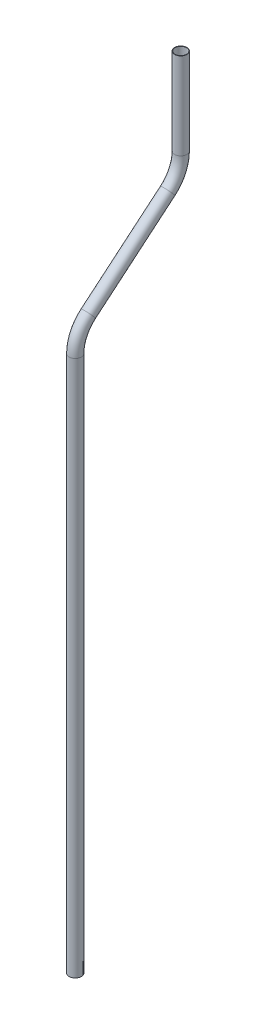
ISO-10303-21;
HEADER;
FILE_DESCRIPTION(('STEP AP214'),'2;1');
FILE_NAME('part.step','',(''),(''),'','','');
FILE_SCHEMA(('AUTOMOTIVE_DESIGN { 1 0 10303 214 1 1 1 1 }'));
ENDSEC;
DATA;
#1=APPLICATION_CONTEXT('core data for automotive mechanical design processes');
#2=APPLICATION_PROTOCOL_DEFINITION('international standard','automotive_design',2000,#1);
#3=PRODUCT_CONTEXT('',#1,'mechanical');
#4=PRODUCT('Part','Part','',(#3));
#5=PRODUCT_RELATED_PRODUCT_CATEGORY('part','',(#4));
#6=PRODUCT_DEFINITION_FORMATION('','',#4);
#7=PRODUCT_DEFINITION_CONTEXT('part definition',#1,'design');
#8=PRODUCT_DEFINITION('design','',#6,#7);
#9=PRODUCT_DEFINITION_SHAPE('','',#8);
#10=(LENGTH_UNIT() NAMED_UNIT(*) SI_UNIT(.MILLI.,.METRE.));
#11=(NAMED_UNIT(*) PLANE_ANGLE_UNIT() SI_UNIT($,.RADIAN.));
#12=(NAMED_UNIT(*) SI_UNIT($,.STERADIAN.) SOLID_ANGLE_UNIT());
#13=UNCERTAINTY_MEASURE_WITH_UNIT(LENGTH_MEASURE(1.E-05),#10,'distance_accuracy_value','');
#14=(GEOMETRIC_REPRESENTATION_CONTEXT(3) GLOBAL_UNCERTAINTY_ASSIGNED_CONTEXT((#13)) GLOBAL_UNIT_ASSIGNED_CONTEXT((#10,
#11,#12)) REPRESENTATION_CONTEXT('',''));
#15=CARTESIAN_POINT('',(0.,0.,0.));
#16=DIRECTION('',(0.,0.,1.));
#17=DIRECTION('',(1.,0.,0.));
#18=AXIS2_PLACEMENT_3D('',#15,#16,#17);
#19=CARTESIAN_POINT('',(0.,0.,0.));
#20=DIRECTION('',(0.,1.,0.));
#21=DIRECTION('',(0.,0.,1.));
#22=AXIS2_PLACEMENT_3D('',#19,#20,#21);
#23=CYLINDRICAL_SURFACE('',#22,6.35);
#24=CARTESIAN_POINT('',(0.,558.8,0.));
#25=DIRECTION('',(0.,1.,0.));
#26=DIRECTION('',(0.,0.,1.));
#27=AXIS2_PLACEMENT_3D('',#24,#25,#26);
#28=CIRCLE('',#27,6.35);
#29=CARTESIAN_POINT('',(0.,558.8,6.34999999999997));
#30=VERTEX_POINT('',#29);
#31=EDGE_CURVE('E55',#30,#30,#28,.T.);
#32=ORIENTED_EDGE('',*,*,#31,.F.);
#33=EDGE_LOOP('',(#32));
#34=FACE_BOUND('',#33,.T.);
#35=CARTESIAN_POINT('',(0.,0.,0.));
#36=DIRECTION('',(0.,1.,0.));
#37=DIRECTION('',(0.,0.,1.));
#38=AXIS2_PLACEMENT_3D('',#35,#36,#37);
#39=CIRCLE('',#38,6.35);
#40=CARTESIAN_POINT('',(0.,0.,6.35));
#41=VERTEX_POINT('',#40);
#42=EDGE_CURVE('E52',#41,#41,#39,.T.);
#43=ORIENTED_EDGE('',*,*,#42,.T.);
#44=EDGE_LOOP('',(#43));
#45=FACE_BOUND('',#44,.T.);
#46=ADVANCED_FACE('F31',(#34,#45),#23,.T.);
#47=CARTESIAN_POINT('',(0.,558.8,-38.1));
#48=DIRECTION('',(-1.,0.,0.));
#49=DIRECTION('',(0.,0.,1.));
#50=AXIS2_PLACEMENT_3D('',#47,#48,#49);
#51=TOROIDAL_SURFACE('',#50,38.1,6.35);
#52=CARTESIAN_POINT('',(0.,587.986293282833,-13.6097920709429));
#53=DIRECTION('',(0.,0.642787609686539,-0.766044443118978));
#54=DIRECTION('',(0.,0.766044443118979,0.642787609686539));
#55=AXIS2_PLACEMENT_3D('',#52,#53,#54);
#56=CIRCLE('',#55,6.35);
#57=CARTESIAN_POINT('',(0.,592.850675496638,-9.52809074943337));
#58=VERTEX_POINT('',#57);
#59=EDGE_CURVE('E58',#58,#58,#56,.T.);
#60=CARTESIAN_POINT('',(0.,558.8,-38.1));
#61=DIRECTION('',(-1.,0.,0.));
#62=DIRECTION('',(0.,0.,1.));
#63=AXIS2_PLACEMENT_3D('',#60,#61,#62);
#64=CIRCLE('',#63,44.45);
#65=EDGE_CURVE('',#30,#58,#64,.T.);
#66=ORIENTED_EDGE('',*,*,#31,.T.);
#67=ORIENTED_EDGE('',*,*,#59,.F.);
#68=ORIENTED_EDGE('',*,*,#65,.T.);
#69=ORIENTED_EDGE('',*,*,#65,.F.);
#70=EDGE_LOOP('',(#66,#68,#67,#69));
#71=FACE_BOUND('',#70,.T.);
#72=ADVANCED_FACE('F77',(#71),#51,.T.);
#73=CARTESIAN_POINT('',(0.,587.986293282833,-13.6097920709429));
#74=DIRECTION('',(0.,0.642787609686537,-0.76604444311898));
#75=DIRECTION('',(0.,0.76604444311898,0.642787609686537));
#76=AXIS2_PLACEMENT_3D('',#73,#74,#75);
#77=CYLINDRICAL_SURFACE('',#76,6.35);
#78=CARTESIAN_POINT('',(0.,657.375215748495,-96.3042897056368));
#79=DIRECTION('',(0.,0.642787609686537,-0.766044443118979));
#80=DIRECTION('',(0.,0.766044443118979,0.642787609686537));
#81=AXIS2_PLACEMENT_3D('',#78,#79,#80);
#82=CIRCLE('',#81,6.35);
#83=CARTESIAN_POINT('',(0.,652.510833534689,-100.385991027146));
#84=VERTEX_POINT('',#83);
#85=EDGE_CURVE('E60',#84,#84,#82,.T.);
#86=ORIENTED_EDGE('',*,*,#85,.F.);
#87=EDGE_LOOP('',(#86));
#88=FACE_BOUND('',#87,.T.);
#89=ORIENTED_EDGE('',*,*,#59,.T.);
#90=EDGE_LOOP('',(#89));
#91=FACE_BOUND('',#90,.T.);
#92=ADVANCED_FACE('F70',(#88,#91),#77,.T.);
#93=CARTESIAN_POINT('',(0.,686.561509031328,-71.8140817765797));
#94=DIRECTION('',(1.,0.,0.));
#95=DIRECTION('',(0.,0.,-1.));
#96=AXIS2_PLACEMENT_3D('',#93,#94,#95);
#97=TOROIDAL_SURFACE('',#96,38.1000000000001,6.35);
#98=CARTESIAN_POINT('',(0.,686.561509031328,-109.91408177658));
#99=DIRECTION('',(0.,1.,0.));
#100=DIRECTION('',(0.,0.,1.));
#101=AXIS2_PLACEMENT_3D('',#98,#99,#100);
#102=CIRCLE('',#101,6.35);
#103=CARTESIAN_POINT('',(0.,686.561509031328,-116.26408177658));
#104=VERTEX_POINT('',#103);
#105=EDGE_CURVE('E35',#104,#104,#102,.T.);
#106=CARTESIAN_POINT('',(0.,686.561509031328,-71.8140817765797));
#107=DIRECTION('',(1.,0.,0.));
#108=DIRECTION('',(0.,0.,-1.));
#109=AXIS2_PLACEMENT_3D('',#106,#107,#108);
#110=CIRCLE('',#109,44.4500000000001);
#111=EDGE_CURVE('',#84,#104,#110,.T.);
#112=ORIENTED_EDGE('',*,*,#85,.T.);
#113=ORIENTED_EDGE('',*,*,#105,.F.);
#114=ORIENTED_EDGE('',*,*,#111,.T.);
#115=ORIENTED_EDGE('',*,*,#111,.F.);
#116=EDGE_LOOP('',(#112,#114,#113,#115));
#117=FACE_BOUND('',#116,.T.);
#118=ADVANCED_FACE('F68',(#117),#97,.T.);
#119=CARTESIAN_POINT('',(0.,686.561509031328,-109.91408177658));
#120=DIRECTION('',(0.,1.,0.));
#121=DIRECTION('',(0.,0.,1.));
#122=AXIS2_PLACEMENT_3D('',#119,#120,#121);
#123=CYLINDRICAL_SURFACE('',#122,6.35);
#124=CARTESIAN_POINT('',(0.,776.731509031328,-109.91408177658));
#125=DIRECTION('',(0.,1.,0.));
#126=DIRECTION('',(0.,0.,1.));
#127=AXIS2_PLACEMENT_3D('',#124,#125,#126);
#128=CIRCLE('',#127,6.35);
#129=CARTESIAN_POINT('',(0.,776.731509031328,-103.56408177658));
#130=VERTEX_POINT('',#129);
#131=EDGE_CURVE('E48',#130,#130,#128,.T.);
#132=ORIENTED_EDGE('',*,*,#131,.F.);
#133=EDGE_LOOP('',(#132));
#134=FACE_BOUND('',#133,.T.);
#135=ORIENTED_EDGE('',*,*,#105,.T.);
#136=EDGE_LOOP('',(#135));
#137=FACE_BOUND('',#136,.T.);
#138=ADVANCED_FACE('F33',(#134,#137),#123,.T.);
#139=CARTESIAN_POINT('',(0.,0.,0.));
#140=DIRECTION('',(0.,1.,0.));
#141=DIRECTION('',(0.,0.,1.));
#142=AXIS2_PLACEMENT_3D('',#139,#140,#141);
#143=PLANE('',#142);
#144=CARTESIAN_POINT('',(0.,0.,0.));
#145=DIRECTION('',(0.,1.,0.));
#146=DIRECTION('',(0.,0.,1.));
#147=AXIS2_PLACEMENT_3D('',#144,#145,#146);
#148=CIRCLE('',#147,5.969);
#149=CARTESIAN_POINT('',(0.,0.,5.969));
#150=VERTEX_POINT('',#149);
#151=EDGE_CURVE('E51',#150,#150,#148,.F.);
#152=ORIENTED_EDGE('',*,*,#151,.F.);
#153=EDGE_LOOP('',(#152));
#154=FACE_BOUND('',#153,.T.);
#155=ORIENTED_EDGE('',*,*,#42,.F.);
#156=EDGE_LOOP('',(#155));
#157=FACE_BOUND('',#156,.T.);
#158=ADVANCED_FACE('F75',(#154,#157),#143,.F.);
#159=CARTESIAN_POINT('',(0.,776.731509031328,-109.91408177658));
#160=DIRECTION('',(0.,1.,0.));
#161=DIRECTION('',(0.,0.,1.));
#162=AXIS2_PLACEMENT_3D('',#159,#160,#161);
#163=PLANE('',#162);
#164=CARTESIAN_POINT('',(0.,776.731509031328,-109.91408177658));
#165=DIRECTION('',(0.,1.,0.));
#166=DIRECTION('',(0.,0.,1.));
#167=AXIS2_PLACEMENT_3D('',#164,#165,#166);
#168=CIRCLE('',#167,5.969);
#169=CARTESIAN_POINT('',(0.,776.731509031328,-103.94508177658));
#170=VERTEX_POINT('',#169);
#171=EDGE_CURVE('E10',#170,#170,#168,.F.);
#172=ORIENTED_EDGE('',*,*,#171,.T.);
#173=EDGE_LOOP('',(#172));
#174=FACE_BOUND('',#173,.T.);
#175=ORIENTED_EDGE('',*,*,#131,.T.);
#176=EDGE_LOOP('',(#175));
#177=FACE_BOUND('',#176,.T.);
#178=ADVANCED_FACE('F94',(#174,#177),#163,.T.);
#179=CARTESIAN_POINT('',(0.,0.,0.));
#180=DIRECTION('',(0.,1.,0.));
#181=DIRECTION('',(0.,0.,1.));
#182=AXIS2_PLACEMENT_3D('',#179,#180,#181);
#183=CYLINDRICAL_SURFACE('',#182,5.969);
#184=CARTESIAN_POINT('',(0.,558.8,0.));
#185=DIRECTION('',(0.,1.,0.));
#186=DIRECTION('',(0.,0.,1.));
#187=AXIS2_PLACEMENT_3D('',#184,#185,#186);
#188=CIRCLE('',#187,5.969);
#189=CARTESIAN_POINT('',(0.,558.8,5.96899999999997));
#190=VERTEX_POINT('',#189);
#191=EDGE_CURVE('E190',#190,#190,#188,.F.);
#192=ORIENTED_EDGE('',*,*,#191,.F.);
#193=EDGE_LOOP('',(#192));
#194=FACE_BOUND('',#193,.T.);
#195=ORIENTED_EDGE('',*,*,#151,.T.);
#196=EDGE_LOOP('',(#195));
#197=FACE_BOUND('',#196,.T.);
#198=ADVANCED_FACE('F97',(#194,#197),#183,.F.);
#199=CARTESIAN_POINT('',(0.,558.8,-38.1));
#200=DIRECTION('',(-1.,0.,0.));
#201=DIRECTION('',(0.,0.,1.));
#202=AXIS2_PLACEMENT_3D('',#199,#200,#201);
#203=TOROIDAL_SURFACE('',#202,38.1,5.969);
#204=CARTESIAN_POINT('',(0.,587.986293282833,-13.6097920709429));
#205=DIRECTION('',(0.,0.642787609686539,-0.766044443118978));
#206=DIRECTION('',(0.,0.766044443118979,0.642787609686539));
#207=AXIS2_PLACEMENT_3D('',#204,#205,#206);
#208=CIRCLE('',#207,5.969);
#209=CARTESIAN_POINT('',(0.,592.55881256381,-9.77299282872394));
#210=VERTEX_POINT('',#209);
#211=EDGE_CURVE('E189',#210,#210,#208,.F.);
#212=CARTESIAN_POINT('',(0.,558.8,-38.1));
#213=DIRECTION('',(-1.,0.,0.));
#214=DIRECTION('',(0.,0.,1.));
#215=AXIS2_PLACEMENT_3D('',#212,#213,#214);
#216=CIRCLE('',#215,44.069);
#217=EDGE_CURVE('',#190,#210,#216,.T.);
#218=ORIENTED_EDGE('',*,*,#191,.T.);
#219=ORIENTED_EDGE('',*,*,#211,.F.);
#220=ORIENTED_EDGE('',*,*,#217,.T.);
#221=ORIENTED_EDGE('',*,*,#217,.F.);
#222=EDGE_LOOP('',(#218,#220,#219,#221));
#223=FACE_BOUND('',#222,.T.);
#224=ADVANCED_FACE('F152',(#223),#203,.F.);
#225=CARTESIAN_POINT('',(0.,587.986293282833,-13.6097920709429));
#226=DIRECTION('',(0.,0.642787609686537,-0.76604444311898));
#227=DIRECTION('',(0.,0.76604444311898,0.642787609686537));
#228=AXIS2_PLACEMENT_3D('',#225,#226,#227);
#229=CYLINDRICAL_SURFACE('',#228,5.969);
#230=CARTESIAN_POINT('',(0.,657.375215748495,-96.3042897056368));
#231=DIRECTION('',(0.,0.642787609686537,-0.766044443118979));
#232=DIRECTION('',(0.,0.766044443118979,0.642787609686537));
#233=AXIS2_PLACEMENT_3D('',#230,#231,#232);
#234=CIRCLE('',#233,5.969);
#235=CARTESIAN_POINT('',(0.,652.802696467518,-100.141088947856));
#236=VERTEX_POINT('',#235);
#237=EDGE_CURVE('E44',#236,#236,#234,.F.);
#238=ORIENTED_EDGE('',*,*,#237,.F.);
#239=EDGE_LOOP('',(#238));
#240=FACE_BOUND('',#239,.T.);
#241=ORIENTED_EDGE('',*,*,#211,.T.);
#242=EDGE_LOOP('',(#241));
#243=FACE_BOUND('',#242,.T.);
#244=ADVANCED_FACE('F88',(#240,#243),#229,.F.);
#245=CARTESIAN_POINT('',(0.,686.561509031328,-71.8140817765797));
#246=DIRECTION('',(1.,0.,0.));
#247=DIRECTION('',(0.,0.,-1.));
#248=AXIS2_PLACEMENT_3D('',#245,#246,#247);
#249=TOROIDAL_SURFACE('',#248,38.1000000000001,5.969);
#250=CARTESIAN_POINT('',(0.,686.561509031328,-109.91408177658));
#251=DIRECTION('',(0.,1.,0.));
#252=DIRECTION('',(0.,0.,1.));
#253=AXIS2_PLACEMENT_3D('',#250,#251,#252);
#254=CIRCLE('',#253,5.969);
#255=CARTESIAN_POINT('',(0.,686.561509031328,-115.88308177658));
#256=VERTEX_POINT('',#255);
#257=EDGE_CURVE('E39',#256,#256,#254,.F.);
#258=CARTESIAN_POINT('',(0.,686.561509031328,-71.8140817765797));
#259=DIRECTION('',(1.,0.,0.));
#260=DIRECTION('',(0.,0.,-1.));
#261=AXIS2_PLACEMENT_3D('',#258,#259,#260);
#262=CIRCLE('',#261,44.0690000000001);
#263=EDGE_CURVE('',#236,#256,#262,.T.);
#264=ORIENTED_EDGE('',*,*,#237,.T.);
#265=ORIENTED_EDGE('',*,*,#257,.F.);
#266=ORIENTED_EDGE('',*,*,#263,.T.);
#267=ORIENTED_EDGE('',*,*,#263,.F.);
#268=EDGE_LOOP('',(#264,#266,#265,#267));
#269=FACE_BOUND('',#268,.T.);
#270=ADVANCED_FACE('F82',(#269),#249,.F.);
#271=CARTESIAN_POINT('',(0.,686.561509031328,-109.91408177658));
#272=DIRECTION('',(0.,1.,0.));
#273=DIRECTION('',(0.,0.,1.));
#274=AXIS2_PLACEMENT_3D('',#271,#272,#273);
#275=CYLINDRICAL_SURFACE('',#274,5.969);
#276=ORIENTED_EDGE('',*,*,#171,.F.);
#277=EDGE_LOOP('',(#276));
#278=FACE_BOUND('',#277,.T.);
#279=ORIENTED_EDGE('',*,*,#257,.T.);
#280=EDGE_LOOP('',(#279));
#281=FACE_BOUND('',#280,.T.);
#282=ADVANCED_FACE('F80',(#278,#281),#275,.F.);
#283=CLOSED_SHELL('',(#46,#72,#92,#118,#138,#158,#178,#198,#224,#244,#270,#282));
#284=MANIFOLD_SOLID_BREP('B2',#283);
#285=ADVANCED_BREP_SHAPE_REPRESENTATION('',(#18,#284),#14);
#286=SHAPE_DEFINITION_REPRESENTATION(#9,#285);
ENDSEC;
END-ISO-10303-21;
